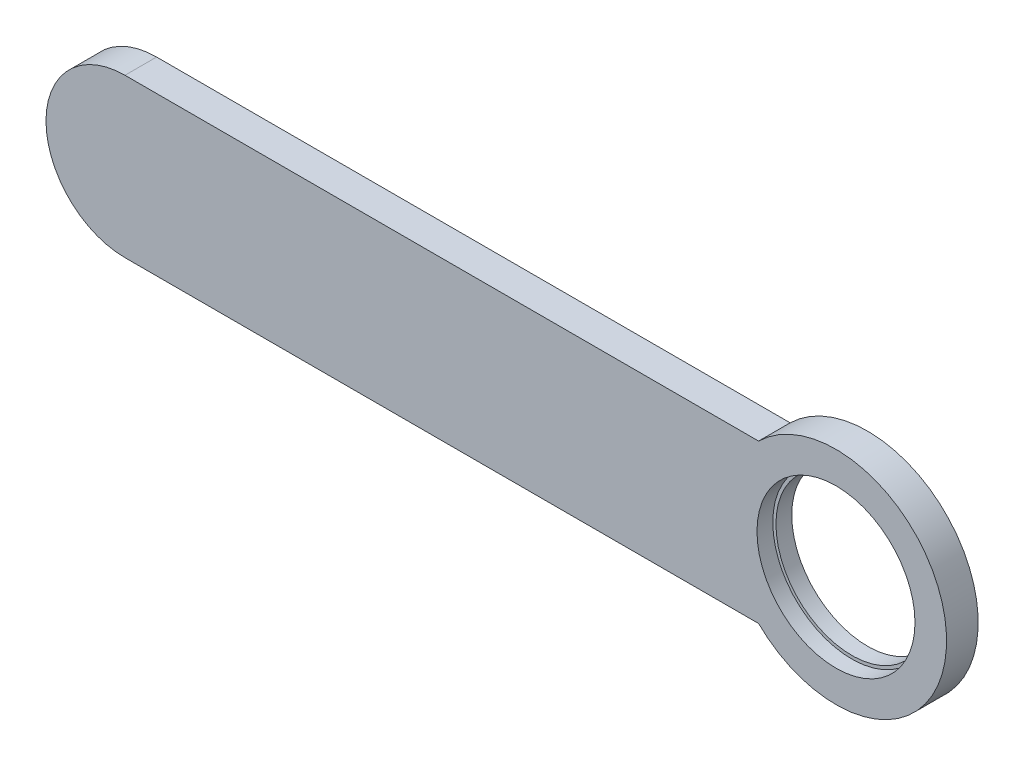
ISO-10303-21;
HEADER;
FILE_DESCRIPTION(('STEP AP214'),'2;1');
FILE_NAME('part.step','',(''),(''),'','','');
FILE_SCHEMA(('AUTOMOTIVE_DESIGN { 1 0 10303 214 1 1 1 1 }'));
ENDSEC;
DATA;
#1=APPLICATION_CONTEXT('core data for automotive mechanical design processes');
#2=APPLICATION_PROTOCOL_DEFINITION('international standard','automotive_design',2000,#1);
#3=PRODUCT_CONTEXT('',#1,'mechanical');
#4=PRODUCT('Part','Part','',(#3));
#5=PRODUCT_RELATED_PRODUCT_CATEGORY('part','',(#4));
#6=PRODUCT_DEFINITION_FORMATION('','',#4);
#7=PRODUCT_DEFINITION_CONTEXT('part definition',#1,'design');
#8=PRODUCT_DEFINITION('design','',#6,#7);
#9=PRODUCT_DEFINITION_SHAPE('','',#8);
#10=(LENGTH_UNIT() NAMED_UNIT(*) SI_UNIT(.MILLI.,.METRE.));
#11=(NAMED_UNIT(*) PLANE_ANGLE_UNIT() SI_UNIT($,.RADIAN.));
#12=(NAMED_UNIT(*) SI_UNIT($,.STERADIAN.) SOLID_ANGLE_UNIT());
#13=UNCERTAINTY_MEASURE_WITH_UNIT(LENGTH_MEASURE(1.E-05),#10,'distance_accuracy_value','');
#14=(GEOMETRIC_REPRESENTATION_CONTEXT(3) GLOBAL_UNCERTAINTY_ASSIGNED_CONTEXT((#13)) GLOBAL_UNIT_ASSIGNED_CONTEXT((#10,
#11,#12)) REPRESENTATION_CONTEXT('',''));
#15=CARTESIAN_POINT('',(0.,0.,0.));
#16=DIRECTION('',(0.,0.,1.));
#17=DIRECTION('',(1.,0.,0.));
#18=AXIS2_PLACEMENT_3D('',#15,#16,#17);
#19=CARTESIAN_POINT('',(0.,0.,20.));
#20=DIRECTION('',(0.,0.,1.));
#21=DIRECTION('',(1.,0.,0.));
#22=AXIS2_PLACEMENT_3D('',#19,#20,#21);
#23=PLANE('',#22);
#24=CARTESIAN_POINT('',(0.,0.,20.));
#25=DIRECTION('',(0.,0.,1.));
#26=DIRECTION('',(1.,0.,0.));
#27=AXIS2_PLACEMENT_3D('',#24,#25,#26);
#28=CIRCLE('',#27,50.);
#29=CARTESIAN_POINT('',(50.,0.,20.));
#30=VERTEX_POINT('',#29);
#31=EDGE_CURVE('E131',#30,#30,#28,.T.);
#32=ORIENTED_EDGE('',*,*,#31,.F.);
#33=EDGE_LOOP('',(#32));
#34=FACE_BOUND('',#33,.T.);
#35=DIRECTION('',(-1.,0.,0.));
#36=VECTOR('',#35,1.);
#37=CARTESIAN_POINT('',(-450.,-50.0000000000001,20.));
#38=LINE('',#37,#36);
#39=CARTESIAN_POINT('',(-48.9897948556635,-50.0000000000001,20.));
#40=VERTEX_POINT('',#39);
#41=CARTESIAN_POINT('',(-450.,-50.0000000000001,20.));
#42=VERTEX_POINT('',#41);
#43=EDGE_CURVE('E88',#40,#42,#38,.T.);
#44=ORIENTED_EDGE('',*,*,#43,.F.);
#45=CARTESIAN_POINT('',(0.,0.,20.));
#46=DIRECTION('',(0.,0.,1.));
#47=DIRECTION('',(1.,0.,0.));
#48=AXIS2_PLACEMENT_3D('',#45,#46,#47);
#49=CIRCLE('',#48,70.);
#50=CARTESIAN_POINT('',(-48.9897948556636,50.,20.));
#51=VERTEX_POINT('',#50);
#52=EDGE_CURVE('E12',#40,#51,#49,.T.);
#53=ORIENTED_EDGE('',*,*,#52,.T.);
#54=DIRECTION('',(1.,0.,0.));
#55=VECTOR('',#54,1.);
#56=CARTESIAN_POINT('',(-450.,50.,20.));
#57=LINE('',#56,#55);
#58=CARTESIAN_POINT('',(-450.,50.,20.));
#59=VERTEX_POINT('',#58);
#60=EDGE_CURVE('E82',#59,#51,#57,.T.);
#61=ORIENTED_EDGE('',*,*,#60,.F.);
#62=CARTESIAN_POINT('',(-450.,0.,20.));
#63=DIRECTION('',(0.,0.,-1.));
#64=DIRECTION('',(-1.,0.,0.));
#65=AXIS2_PLACEMENT_3D('',#62,#63,#64);
#66=CIRCLE('',#65,50.);
#67=EDGE_CURVE('E91',#42,#59,#66,.T.);
#68=ORIENTED_EDGE('',*,*,#67,.F.);
#69=EDGE_LOOP('',(#44,#53,#61,#68));
#70=FACE_BOUND('',#69,.T.);
#71=ADVANCED_FACE('F39',(#34,#70),#23,.T.);
#72=CARTESIAN_POINT('',(0.,0.,0.));
#73=DIRECTION('',(0.,0.,1.));
#74=DIRECTION('',(1.,0.,0.));
#75=AXIS2_PLACEMENT_3D('',#72,#73,#74);
#76=PLANE('',#75);
#77=CARTESIAN_POINT('',(0.,0.,0.));
#78=DIRECTION('',(0.,0.,-1.));
#79=DIRECTION('',(-1.,0.,0.));
#80=AXIS2_PLACEMENT_3D('',#77,#78,#79);
#81=CIRCLE('',#80,48.);
#82=CARTESIAN_POINT('',(-48.,0.,0.));
#83=VERTEX_POINT('',#82);
#84=EDGE_CURVE('E113',#83,#83,#81,.T.);
#85=ORIENTED_EDGE('',*,*,#84,.F.);
#86=EDGE_LOOP('',(#85));
#87=FACE_BOUND('',#86,.T.);
#88=CARTESIAN_POINT('',(0.,0.,0.));
#89=DIRECTION('',(0.,0.,1.));
#90=DIRECTION('',(1.,0.,0.));
#91=AXIS2_PLACEMENT_3D('',#88,#89,#90);
#92=CIRCLE('',#91,70.);
#93=CARTESIAN_POINT('',(-48.9897948556635,-50.0000000000001,0.));
#94=VERTEX_POINT('',#93);
#95=CARTESIAN_POINT('',(-48.9897948556636,50.,0.));
#96=VERTEX_POINT('',#95);
#97=EDGE_CURVE('E43',#94,#96,#92,.T.);
#98=ORIENTED_EDGE('',*,*,#97,.F.);
#99=DIRECTION('',(-1.,0.,0.));
#100=VECTOR('',#99,1.);
#101=CARTESIAN_POINT('',(-450.,-50.0000000000001,0.));
#102=LINE('',#101,#100);
#103=CARTESIAN_POINT('',(-450.,-50.0000000000001,0.));
#104=VERTEX_POINT('',#103);
#105=EDGE_CURVE('E96',#94,#104,#102,.T.);
#106=ORIENTED_EDGE('',*,*,#105,.T.);
#107=CARTESIAN_POINT('',(-450.,0.,0.));
#108=DIRECTION('',(0.,0.,-1.));
#109=DIRECTION('',(-1.,0.,0.));
#110=AXIS2_PLACEMENT_3D('',#107,#108,#109);
#111=CIRCLE('',#110,50.);
#112=CARTESIAN_POINT('',(-450.,50.,0.));
#113=VERTEX_POINT('',#112);
#114=EDGE_CURVE('E103',#104,#113,#111,.T.);
#115=ORIENTED_EDGE('',*,*,#114,.T.);
#116=DIRECTION('',(1.,0.,0.));
#117=VECTOR('',#116,1.);
#118=CARTESIAN_POINT('',(-450.,50.,0.));
#119=LINE('',#118,#117);
#120=EDGE_CURVE('E84',#113,#96,#119,.T.);
#121=ORIENTED_EDGE('',*,*,#120,.T.);
#122=EDGE_LOOP('',(#98,#106,#115,#121));
#123=FACE_BOUND('',#122,.T.);
#124=ADVANCED_FACE('F141',(#87,#123),#76,.F.);
#125=CARTESIAN_POINT('',(0.,0.,20.));
#126=DIRECTION('',(0.,0.,-1.));
#127=DIRECTION('',(-1.,0.,0.));
#128=AXIS2_PLACEMENT_3D('',#125,#126,#127);
#129=CYLINDRICAL_SURFACE('',#128,50.);
#130=ORIENTED_EDGE('',*,*,#31,.T.);
#131=EDGE_LOOP('',(#130));
#132=FACE_BOUND('',#131,.T.);
#133=CARTESIAN_POINT('',(0.,0.,10.));
#134=DIRECTION('',(0.,0.,-1.));
#135=DIRECTION('',(-1.,0.,0.));
#136=AXIS2_PLACEMENT_3D('',#133,#134,#135);
#137=CIRCLE('',#136,50.);
#138=CARTESIAN_POINT('',(-50.,0.,10.));
#139=VERTEX_POINT('',#138);
#140=EDGE_CURVE('E124',#139,#139,#137,.T.);
#141=ORIENTED_EDGE('',*,*,#140,.T.);
#142=EDGE_LOOP('',(#141));
#143=FACE_BOUND('',#142,.T.);
#144=ADVANCED_FACE('F160',(#132,#143),#129,.F.);
#145=CARTESIAN_POINT('',(0.,0.,20.));
#146=DIRECTION('',(0.,0.,-1.));
#147=DIRECTION('',(-1.,0.,0.));
#148=AXIS2_PLACEMENT_3D('',#145,#146,#147);
#149=CYLINDRICAL_SURFACE('',#148,70.);
#150=ORIENTED_EDGE('',*,*,#97,.T.);
#151=DIRECTION('',(0.,0.,-1.));
#152=VECTOR('',#151,1.);
#153=CARTESIAN_POINT('',(-48.9897948556636,50.,20.));
#154=LINE('',#153,#152);
#155=EDGE_CURVE('E87',#51,#96,#154,.T.);
#156=ORIENTED_EDGE('',*,*,#155,.F.);
#157=ORIENTED_EDGE('',*,*,#52,.F.);
#158=DIRECTION('',(0.,0.,-1.));
#159=VECTOR('',#158,1.);
#160=CARTESIAN_POINT('',(-48.9897948556635,-50.0000000000001,20.));
#161=LINE('',#160,#159);
#162=EDGE_CURVE('E114',#40,#94,#161,.T.);
#163=ORIENTED_EDGE('',*,*,#162,.T.);
#164=EDGE_LOOP('',(#150,#156,#157,#163));
#165=FACE_BOUND('',#164,.T.);
#166=ADVANCED_FACE('F41',(#165),#149,.T.);
#167=CARTESIAN_POINT('',(0.,0.,10.));
#168=DIRECTION('',(0.,0.,-1.));
#169=DIRECTION('',(-1.,0.,0.));
#170=AXIS2_PLACEMENT_3D('',#167,#168,#169);
#171=PLANE('',#170);
#172=CARTESIAN_POINT('',(0.,0.,10.));
#173=DIRECTION('',(0.,0.,-1.));
#174=DIRECTION('',(-1.,0.,0.));
#175=AXIS2_PLACEMENT_3D('',#172,#173,#174);
#176=CIRCLE('',#175,48.);
#177=CARTESIAN_POINT('',(-48.,0.,10.));
#178=VERTEX_POINT('',#177);
#179=EDGE_CURVE('E120',#178,#178,#176,.T.);
#180=ORIENTED_EDGE('',*,*,#179,.T.);
#181=EDGE_LOOP('',(#180));
#182=FACE_BOUND('',#181,.T.);
#183=ORIENTED_EDGE('',*,*,#140,.F.);
#184=EDGE_LOOP('',(#183));
#185=FACE_BOUND('',#184,.T.);
#186=ADVANCED_FACE('F165',(#182,#185),#171,.F.);
#187=CARTESIAN_POINT('',(0.,0.,10.));
#188=DIRECTION('',(0.,0.,-1.));
#189=DIRECTION('',(-1.,0.,0.));
#190=AXIS2_PLACEMENT_3D('',#187,#188,#189);
#191=CYLINDRICAL_SURFACE('',#190,48.);
#192=ORIENTED_EDGE('',*,*,#179,.F.);
#193=EDGE_LOOP('',(#192));
#194=FACE_BOUND('',#193,.T.);
#195=ORIENTED_EDGE('',*,*,#84,.T.);
#196=EDGE_LOOP('',(#195));
#197=FACE_BOUND('',#196,.T.);
#198=ADVANCED_FACE('F151',(#194,#197),#191,.F.);
#199=CARTESIAN_POINT('',(-450.,0.,20.));
#200=DIRECTION('',(0.,0.,-1.));
#201=DIRECTION('',(-1.,0.,0.));
#202=AXIS2_PLACEMENT_3D('',#199,#200,#201);
#203=CYLINDRICAL_SURFACE('',#202,50.);
#204=ORIENTED_EDGE('',*,*,#114,.F.);
#205=DIRECTION('',(0.,0.,-1.));
#206=VECTOR('',#205,1.);
#207=CARTESIAN_POINT('',(-450.,-50.0000000000001,20.));
#208=LINE('',#207,#206);
#209=EDGE_CURVE('E93',#42,#104,#208,.T.);
#210=ORIENTED_EDGE('',*,*,#209,.F.);
#211=ORIENTED_EDGE('',*,*,#67,.T.);
#212=DIRECTION('',(0.,0.,-1.));
#213=VECTOR('',#212,1.);
#214=CARTESIAN_POINT('',(-450.,50.,20.));
#215=LINE('',#214,#213);
#216=EDGE_CURVE('E61',#59,#113,#215,.T.);
#217=ORIENTED_EDGE('',*,*,#216,.T.);
#218=EDGE_LOOP('',(#204,#210,#211,#217));
#219=FACE_BOUND('',#218,.T.);
#220=ADVANCED_FACE('F92',(#219),#203,.T.);
#221=CARTESIAN_POINT('',(-450.,-50.0000000000001,20.));
#222=DIRECTION('',(0.,-1.,0.));
#223=DIRECTION('',(0.,0.,-1.));
#224=AXIS2_PLACEMENT_3D('',#221,#222,#223);
#225=PLANE('',#224);
#226=ORIENTED_EDGE('',*,*,#105,.F.);
#227=ORIENTED_EDGE('',*,*,#162,.F.);
#228=ORIENTED_EDGE('',*,*,#43,.T.);
#229=ORIENTED_EDGE('',*,*,#209,.T.);
#230=EDGE_LOOP('',(#226,#227,#228,#229));
#231=FACE_BOUND('',#230,.T.);
#232=ADVANCED_FACE('F143',(#231),#225,.T.);
#233=CARTESIAN_POINT('',(-450.,50.,20.));
#234=DIRECTION('',(0.,1.,0.));
#235=DIRECTION('',(0.,0.,1.));
#236=AXIS2_PLACEMENT_3D('',#233,#234,#235);
#237=PLANE('',#236);
#238=ORIENTED_EDGE('',*,*,#120,.F.);
#239=ORIENTED_EDGE('',*,*,#216,.F.);
#240=ORIENTED_EDGE('',*,*,#60,.T.);
#241=ORIENTED_EDGE('',*,*,#155,.T.);
#242=EDGE_LOOP('',(#238,#239,#240,#241));
#243=FACE_BOUND('',#242,.T.);
#244=ADVANCED_FACE('F80',(#243),#237,.T.);
#245=CLOSED_SHELL('',(#71,#124,#144,#166,#186,#198,#220,#232,#244));
#246=MANIFOLD_SOLID_BREP('B2',#245);
#247=ADVANCED_BREP_SHAPE_REPRESENTATION('',(#18,#246),#14);
#248=SHAPE_DEFINITION_REPRESENTATION(#9,#247);
ENDSEC;
END-ISO-10303-21;
